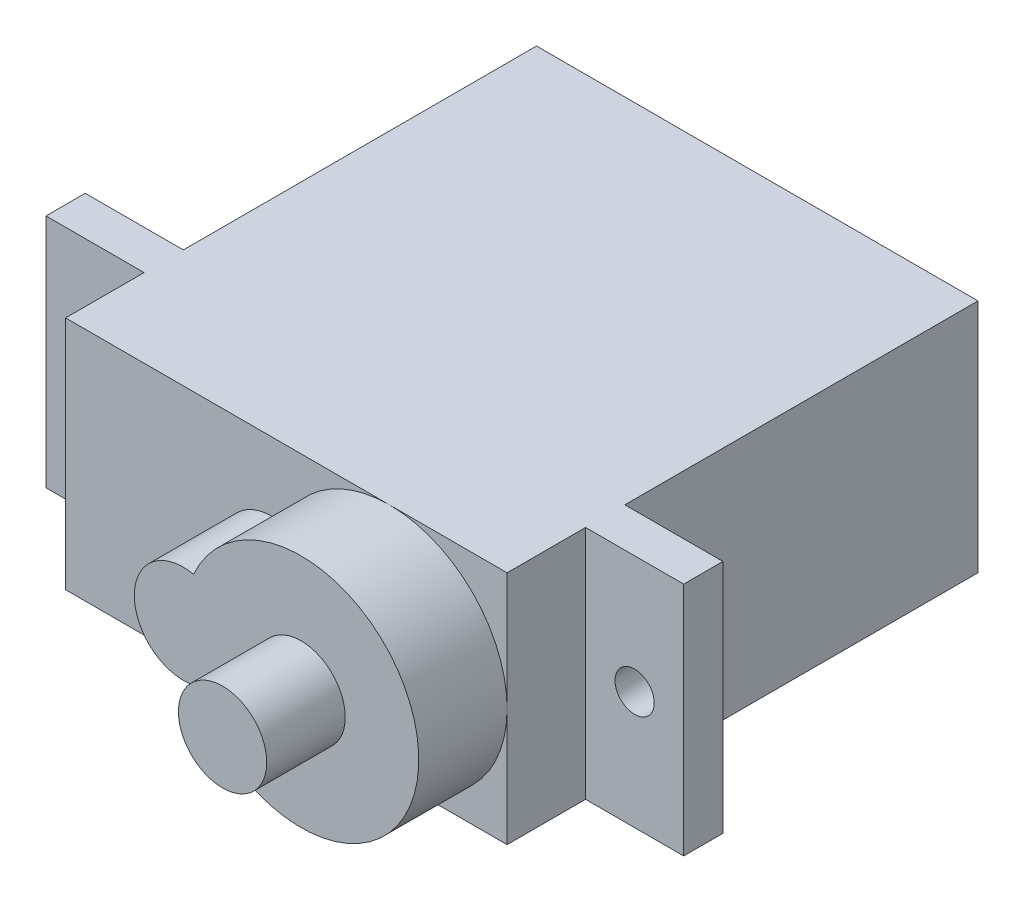
ISO-10303-21;
HEADER;
FILE_DESCRIPTION(('STEP AP214'),'2;1');
FILE_NAME('part.step','',(''),(''),'','','');
FILE_SCHEMA(('AUTOMOTIVE_DESIGN { 1 0 10303 214 1 1 1 1 }'));
ENDSEC;
DATA;
#1=APPLICATION_CONTEXT('core data for automotive mechanical design processes');
#2=APPLICATION_PROTOCOL_DEFINITION('international standard','automotive_design',2000,#1);
#3=PRODUCT_CONTEXT('',#1,'mechanical');
#4=PRODUCT('Part','Part','',(#3));
#5=PRODUCT_RELATED_PRODUCT_CATEGORY('part','',(#4));
#6=PRODUCT_DEFINITION_FORMATION('','',#4);
#7=PRODUCT_DEFINITION_CONTEXT('part definition',#1,'design');
#8=PRODUCT_DEFINITION('design','',#6,#7);
#9=PRODUCT_DEFINITION_SHAPE('','',#8);
#10=(LENGTH_UNIT() NAMED_UNIT(*) SI_UNIT(.MILLI.,.METRE.));
#11=(NAMED_UNIT(*) PLANE_ANGLE_UNIT() SI_UNIT($,.RADIAN.));
#12=(NAMED_UNIT(*) SI_UNIT($,.STERADIAN.) SOLID_ANGLE_UNIT());
#13=UNCERTAINTY_MEASURE_WITH_UNIT(LENGTH_MEASURE(1.E-05),#10,'distance_accuracy_value','');
#14=(GEOMETRIC_REPRESENTATION_CONTEXT(3) GLOBAL_UNCERTAINTY_ASSIGNED_CONTEXT((#13)) GLOBAL_UNIT_ASSIGNED_CONTEXT((#10,
#11,#12)) REPRESENTATION_CONTEXT('',''));
#15=CARTESIAN_POINT('',(0.,0.,0.));
#16=DIRECTION('',(0.,0.,1.));
#17=DIRECTION('',(1.,0.,0.));
#18=AXIS2_PLACEMENT_3D('',#15,#16,#17);
#19=CARTESIAN_POINT('',(0.,0.,24.));
#20=DIRECTION('',(0.,0.,1.));
#21=DIRECTION('',(1.,0.,0.));
#22=AXIS2_PLACEMENT_3D('',#19,#20,#21);
#23=PLANE('',#22);
#24=CARTESIAN_POINT('',(-0.750000000000016,0.,24.));
#25=DIRECTION('',(0.,0.,1.));
#26=DIRECTION('',(1.,0.,0.));
#27=AXIS2_PLACEMENT_3D('',#24,#25,#26);
#28=CIRCLE('',#27,2.5);
#29=CARTESIAN_POINT('',(-0.229166666666671,2.44514470714697,24.));
#30=VERTEX_POINT('',#29);
#31=CARTESIAN_POINT('',(-0.229166666666669,-2.44514470714698,24.));
#32=VERTEX_POINT('',#31);
#33=EDGE_CURVE('E162',#30,#32,#28,.T.);
#34=ORIENTED_EDGE('',*,*,#33,.F.);
#35=CARTESIAN_POINT('',(5.25,0.,24.));
#36=DIRECTION('',(0.,0.,1.));
#37=DIRECTION('',(1.,0.,0.));
#38=AXIS2_PLACEMENT_3D('',#35,#36,#37);
#39=CIRCLE('',#38,6.);
#40=CARTESIAN_POINT('',(5.25,6.,24.));
#41=VERTEX_POINT('',#40);
#42=EDGE_CURVE('E58',#41,#30,#39,.T.);
#43=ORIENTED_EDGE('',*,*,#42,.F.);
#44=DIRECTION('',(-1.,0.,0.));
#45=VECTOR('',#44,1.);
#46=CARTESIAN_POINT('',(-11.25,6.,24.));
#47=LINE('',#46,#45);
#48=CARTESIAN_POINT('',(-11.25,6.,24.));
#49=VERTEX_POINT('',#48);
#50=EDGE_CURVE('E186',#41,#49,#47,.T.);
#51=ORIENTED_EDGE('',*,*,#50,.T.);
#52=DIRECTION('',(0.,-1.,0.));
#53=VECTOR('',#52,1.);
#54=CARTESIAN_POINT('',(-11.25,6.,24.));
#55=LINE('',#54,#53);
#56=CARTESIAN_POINT('',(-11.25,-6.,24.));
#57=VERTEX_POINT('',#56);
#58=EDGE_CURVE('E175',#49,#57,#55,.T.);
#59=ORIENTED_EDGE('',*,*,#58,.T.);
#60=DIRECTION('',(1.,0.,0.));
#61=VECTOR('',#60,1.);
#62=CARTESIAN_POINT('',(-11.25,-6.,24.));
#63=LINE('',#62,#61);
#64=CARTESIAN_POINT('',(5.25,-6.,24.));
#65=VERTEX_POINT('',#64);
#66=EDGE_CURVE('E180',#57,#65,#63,.T.);
#67=ORIENTED_EDGE('',*,*,#66,.T.);
#68=EDGE_CURVE('E46',#32,#65,#39,.T.);
#69=ORIENTED_EDGE('',*,*,#68,.F.);
#70=EDGE_LOOP('',(#34,#43,#51,#59,#67,#69));
#71=FACE_BOUND('',#70,.T.);
#72=ADVANCED_FACE('F35',(#71),#23,.T.);
#73=CARTESIAN_POINT('',(11.25,0.,24.));
#74=VERTEX_POINT('',#73);
#75=EDGE_CURVE('E11',#65,#74,#39,.T.);
#76=ORIENTED_EDGE('',*,*,#75,.F.);
#77=CARTESIAN_POINT('',(11.25,-6.,24.));
#78=VERTEX_POINT('',#77);
#79=EDGE_CURVE('E178',#65,#78,#63,.T.);
#80=ORIENTED_EDGE('',*,*,#79,.T.);
#81=DIRECTION('',(0.,1.,0.));
#82=VECTOR('',#81,1.);
#83=CARTESIAN_POINT('',(11.25,6.,24.));
#84=LINE('',#83,#82);
#85=EDGE_CURVE('E183',#78,#74,#84,.T.);
#86=ORIENTED_EDGE('',*,*,#85,.T.);
#87=EDGE_LOOP('',(#76,#80,#86));
#88=FACE_BOUND('',#87,.T.);
#89=ADVANCED_FACE('F369',(#88),#23,.T.);
#90=CARTESIAN_POINT('',(0.,0.,20.));
#91=DIRECTION('',(0.,0.,1.));
#92=DIRECTION('',(1.,0.,0.));
#93=AXIS2_PLACEMENT_3D('',#90,#91,#92);
#94=PLANE('',#93);
#95=CARTESIAN_POINT('',(-13.75,0.,20.));
#96=DIRECTION('',(0.,0.,1.));
#97=DIRECTION('',(1.,0.,0.));
#98=AXIS2_PLACEMENT_3D('',#95,#96,#97);
#99=CIRCLE('',#98,1.);
#100=CARTESIAN_POINT('',(-12.75,0.,20.));
#101=VERTEX_POINT('',#100);
#102=EDGE_CURVE('E172',#101,#101,#99,.T.);
#103=ORIENTED_EDGE('',*,*,#102,.F.);
#104=EDGE_LOOP('',(#103));
#105=FACE_BOUND('',#104,.T.);
#106=DIRECTION('',(0.,-1.,0.));
#107=VECTOR('',#106,1.);
#108=CARTESIAN_POINT('',(-11.25,6.,20.));
#109=LINE('',#108,#107);
#110=CARTESIAN_POINT('',(-11.25,6.,20.));
#111=VERTEX_POINT('',#110);
#112=CARTESIAN_POINT('',(-11.25,-6.,20.));
#113=VERTEX_POINT('',#112);
#114=EDGE_CURVE('E196',#111,#113,#109,.T.);
#115=ORIENTED_EDGE('',*,*,#114,.F.);
#116=DIRECTION('',(-1.,0.,0.));
#117=VECTOR('',#116,1.);
#118=CARTESIAN_POINT('',(-16.25,6.,20.));
#119=LINE('',#118,#117);
#120=CARTESIAN_POINT('',(-16.25,6.,20.));
#121=VERTEX_POINT('',#120);
#122=EDGE_CURVE('E317',#111,#121,#119,.T.);
#123=ORIENTED_EDGE('',*,*,#122,.T.);
#124=DIRECTION('',(0.,-1.,0.));
#125=VECTOR('',#124,1.);
#126=CARTESIAN_POINT('',(-16.25,6.,20.));
#127=LINE('',#126,#125);
#128=CARTESIAN_POINT('',(-16.25,-6.,20.));
#129=VERTEX_POINT('',#128);
#130=EDGE_CURVE('E315',#121,#129,#127,.T.);
#131=ORIENTED_EDGE('',*,*,#130,.T.);
#132=DIRECTION('',(1.,0.,0.));
#133=VECTOR('',#132,1.);
#134=CARTESIAN_POINT('',(-16.25,-6.,20.));
#135=LINE('',#134,#133);
#136=EDGE_CURVE('E308',#129,#113,#135,.T.);
#137=ORIENTED_EDGE('',*,*,#136,.T.);
#138=EDGE_LOOP('',(#115,#123,#131,#137));
#139=FACE_BOUND('',#138,.T.);
#140=ADVANCED_FACE('F375',(#105,#139),#94,.T.);
#141=CARTESIAN_POINT('',(-11.25,6.,18.));
#142=DIRECTION('',(1.,0.,0.));
#143=DIRECTION('',(0.,0.,-1.));
#144=AXIS2_PLACEMENT_3D('',#141,#142,#143);
#145=PLANE('',#144);
#146=DIRECTION('',(0.,-1.,0.));
#147=VECTOR('',#146,1.);
#148=CARTESIAN_POINT('',(-11.25,6.,0.));
#149=LINE('',#148,#147);
#150=CARTESIAN_POINT('',(-11.25,6.,0.));
#151=VERTEX_POINT('',#150);
#152=CARTESIAN_POINT('',(-11.25,-6.,0.));
#153=VERTEX_POINT('',#152);
#154=EDGE_CURVE('E267',#151,#153,#149,.T.);
#155=ORIENTED_EDGE('',*,*,#154,.T.);
#156=DIRECTION('',(0.,0.,-1.));
#157=VECTOR('',#156,1.);
#158=CARTESIAN_POINT('',(-11.25,-6.,18.));
#159=LINE('',#158,#157);
#160=CARTESIAN_POINT('',(-11.25,-6.,18.));
#161=VERTEX_POINT('',#160);
#162=EDGE_CURVE('E295',#161,#153,#159,.T.);
#163=ORIENTED_EDGE('',*,*,#162,.F.);
#164=DIRECTION('',(0.,-1.,0.));
#165=VECTOR('',#164,1.);
#166=CARTESIAN_POINT('',(-11.25,6.,18.));
#167=LINE('',#166,#165);
#168=CARTESIAN_POINT('',(-11.25,6.,18.));
#169=VERTEX_POINT('',#168);
#170=EDGE_CURVE('E282',#169,#161,#167,.T.);
#171=ORIENTED_EDGE('',*,*,#170,.F.);
#172=DIRECTION('',(0.,0.,-1.));
#173=VECTOR('',#172,1.);
#174=CARTESIAN_POINT('',(-11.25,6.,18.));
#175=LINE('',#174,#173);
#176=EDGE_CURVE('E287',#169,#151,#175,.T.);
#177=ORIENTED_EDGE('',*,*,#176,.T.);
#178=EDGE_LOOP('',(#155,#163,#171,#177));
#179=FACE_BOUND('',#178,.T.);
#180=ADVANCED_FACE('F37',(#179),#145,.F.);
#181=CARTESIAN_POINT('',(-11.25,-6.,18.));
#182=DIRECTION('',(0.,1.,0.));
#183=DIRECTION('',(0.,0.,1.));
#184=AXIS2_PLACEMENT_3D('',#181,#182,#183);
#185=PLANE('',#184);
#186=DIRECTION('',(1.,0.,0.));
#187=VECTOR('',#186,1.);
#188=CARTESIAN_POINT('',(-11.25,-6.,0.));
#189=LINE('',#188,#187);
#190=CARTESIAN_POINT('',(11.25,-6.,0.));
#191=VERTEX_POINT('',#190);
#192=EDGE_CURVE('E269',#153,#191,#189,.T.);
#193=ORIENTED_EDGE('',*,*,#192,.T.);
#194=DIRECTION('',(0.,0.,-1.));
#195=VECTOR('',#194,1.);
#196=CARTESIAN_POINT('',(11.25,-6.,18.));
#197=LINE('',#196,#195);
#198=CARTESIAN_POINT('',(11.25,-6.,18.));
#199=VERTEX_POINT('',#198);
#200=EDGE_CURVE('E286',#199,#191,#197,.T.);
#201=ORIENTED_EDGE('',*,*,#200,.F.);
#202=DIRECTION('',(1.,0.,0.));
#203=VECTOR('',#202,1.);
#204=CARTESIAN_POINT('',(-16.25,-6.,18.));
#205=LINE('',#204,#203);
#206=CARTESIAN_POINT('',(16.25,-6.,18.));
#207=VERTEX_POINT('',#206);
#208=EDGE_CURVE('E229',#199,#207,#205,.T.);
#209=ORIENTED_EDGE('',*,*,#208,.T.);
#210=DIRECTION('',(0.,0.,-1.));
#211=VECTOR('',#210,1.);
#212=CARTESIAN_POINT('',(16.25,-6.,20.));
#213=LINE('',#212,#211);
#214=CARTESIAN_POINT('',(16.25,-6.,20.));
#215=VERTEX_POINT('',#214);
#216=EDGE_CURVE('E263',#215,#207,#213,.T.);
#217=ORIENTED_EDGE('',*,*,#216,.F.);
#218=CARTESIAN_POINT('',(11.25,-6.,20.));
#219=VERTEX_POINT('',#218);
#220=EDGE_CURVE('E312',#219,#215,#135,.T.);
#221=ORIENTED_EDGE('',*,*,#220,.F.);
#222=DIRECTION('',(0.,0.,-1.));
#223=VECTOR('',#222,1.);
#224=CARTESIAN_POINT('',(11.25,-6.,24.));
#225=LINE('',#224,#223);
#226=EDGE_CURVE('E209',#78,#219,#225,.T.);
#227=ORIENTED_EDGE('',*,*,#226,.F.);
#228=ORIENTED_EDGE('',*,*,#79,.F.);
#229=ORIENTED_EDGE('',*,*,#66,.F.);
#230=DIRECTION('',(0.,0.,-1.));
#231=VECTOR('',#230,1.);
#232=CARTESIAN_POINT('',(-11.25,-6.,24.));
#233=LINE('',#232,#231);
#234=EDGE_CURVE('E216',#57,#113,#233,.T.);
#235=ORIENTED_EDGE('',*,*,#234,.T.);
#236=ORIENTED_EDGE('',*,*,#136,.F.);
#237=DIRECTION('',(0.,0.,-1.));
#238=VECTOR('',#237,1.);
#239=CARTESIAN_POINT('',(-16.25,-6.,20.));
#240=LINE('',#239,#238);
#241=CARTESIAN_POINT('',(-16.25,-6.,18.));
#242=VERTEX_POINT('',#241);
#243=EDGE_CURVE('E265',#129,#242,#240,.T.);
#244=ORIENTED_EDGE('',*,*,#243,.T.);
#245=EDGE_CURVE('E235',#242,#161,#205,.T.);
#246=ORIENTED_EDGE('',*,*,#245,.T.);
#247=ORIENTED_EDGE('',*,*,#162,.T.);
#248=EDGE_LOOP('',(#193,#201,#209,#217,#221,#227,#228,#229,#235,#236,#244,#246,#247));
#249=FACE_BOUND('',#248,.T.);
#250=ADVANCED_FACE('F334',(#249),#185,.F.);
#251=CARTESIAN_POINT('',(11.25,6.,18.));
#252=DIRECTION('',(-1.,0.,0.));
#253=DIRECTION('',(0.,-1.,0.));
#254=AXIS2_PLACEMENT_3D('',#251,#252,#253);
#255=PLANE('',#254);
#256=DIRECTION('',(0.,1.,0.));
#257=VECTOR('',#256,1.);
#258=CARTESIAN_POINT('',(11.25,6.,0.));
#259=LINE('',#258,#257);
#260=CARTESIAN_POINT('',(11.25,6.,0.));
#261=VERTEX_POINT('',#260);
#262=EDGE_CURVE('E274',#191,#261,#259,.T.);
#263=ORIENTED_EDGE('',*,*,#262,.T.);
#264=DIRECTION('',(0.,0.,-1.));
#265=VECTOR('',#264,1.);
#266=CARTESIAN_POINT('',(11.25,6.,18.));
#267=LINE('',#266,#265);
#268=CARTESIAN_POINT('',(11.25,6.,18.));
#269=VERTEX_POINT('',#268);
#270=EDGE_CURVE('E283',#269,#261,#267,.T.);
#271=ORIENTED_EDGE('',*,*,#270,.F.);
#272=DIRECTION('',(0.,1.,0.));
#273=VECTOR('',#272,1.);
#274=CARTESIAN_POINT('',(11.25,6.,18.));
#275=LINE('',#274,#273);
#276=EDGE_CURVE('E290',#199,#269,#275,.T.);
#277=ORIENTED_EDGE('',*,*,#276,.F.);
#278=ORIENTED_EDGE('',*,*,#200,.T.);
#279=EDGE_LOOP('',(#263,#271,#277,#278));
#280=FACE_BOUND('',#279,.T.);
#281=ADVANCED_FACE('F347',(#280),#255,.F.);
#282=CARTESIAN_POINT('',(-11.25,6.,18.));
#283=DIRECTION('',(0.,-1.,0.));
#284=DIRECTION('',(0.,0.,-1.));
#285=AXIS2_PLACEMENT_3D('',#282,#283,#284);
#286=PLANE('',#285);
#287=DIRECTION('',(-1.,0.,0.));
#288=VECTOR('',#287,1.);
#289=CARTESIAN_POINT('',(-11.25,6.,0.));
#290=LINE('',#289,#288);
#291=EDGE_CURVE('E280',#261,#151,#290,.T.);
#292=ORIENTED_EDGE('',*,*,#291,.T.);
#293=ORIENTED_EDGE('',*,*,#176,.F.);
#294=DIRECTION('',(-1.,0.,0.));
#295=VECTOR('',#294,1.);
#296=CARTESIAN_POINT('',(-16.25,6.,18.));
#297=LINE('',#296,#295);
#298=CARTESIAN_POINT('',(-16.25,6.,18.));
#299=VERTEX_POINT('',#298);
#300=EDGE_CURVE('E250',#169,#299,#297,.T.);
#301=ORIENTED_EDGE('',*,*,#300,.T.);
#302=DIRECTION('',(0.,0.,-1.));
#303=VECTOR('',#302,1.);
#304=CARTESIAN_POINT('',(-16.25,6.,20.));
#305=LINE('',#304,#303);
#306=EDGE_CURVE('E256',#121,#299,#305,.T.);
#307=ORIENTED_EDGE('',*,*,#306,.F.);
#308=ORIENTED_EDGE('',*,*,#122,.F.);
#309=DIRECTION('',(0.,0.,-1.));
#310=VECTOR('',#309,1.);
#311=CARTESIAN_POINT('',(-11.25,6.,24.));
#312=LINE('',#311,#310);
#313=EDGE_CURVE('E190',#49,#111,#312,.T.);
#314=ORIENTED_EDGE('',*,*,#313,.F.);
#315=ORIENTED_EDGE('',*,*,#50,.F.);
#316=CARTESIAN_POINT('',(11.25,6.,24.));
#317=VERTEX_POINT('',#316);
#318=EDGE_CURVE('E187',#317,#41,#47,.T.);
#319=ORIENTED_EDGE('',*,*,#318,.F.);
#320=DIRECTION('',(0.,0.,-1.));
#321=VECTOR('',#320,1.);
#322=CARTESIAN_POINT('',(11.25,6.,24.));
#323=LINE('',#322,#321);
#324=CARTESIAN_POINT('',(11.25,6.,20.));
#325=VERTEX_POINT('',#324);
#326=EDGE_CURVE('E203',#317,#325,#323,.T.);
#327=ORIENTED_EDGE('',*,*,#326,.T.);
#328=CARTESIAN_POINT('',(16.25,6.,20.));
#329=VERTEX_POINT('',#328);
#330=EDGE_CURVE('E260',#329,#325,#119,.T.);
#331=ORIENTED_EDGE('',*,*,#330,.F.);
#332=DIRECTION('',(0.,0.,-1.));
#333=VECTOR('',#332,1.);
#334=CARTESIAN_POINT('',(16.25,6.,20.));
#335=LINE('',#334,#333);
#336=CARTESIAN_POINT('',(16.25,6.,18.));
#337=VERTEX_POINT('',#336);
#338=EDGE_CURVE('E259',#329,#337,#335,.T.);
#339=ORIENTED_EDGE('',*,*,#338,.T.);
#340=EDGE_CURVE('E252',#337,#269,#297,.T.);
#341=ORIENTED_EDGE('',*,*,#340,.T.);
#342=ORIENTED_EDGE('',*,*,#270,.T.);
#343=EDGE_LOOP('',(#292,#293,#301,#307,#308,#314,#315,#319,#327,#331,#339,#341,#342));
#344=FACE_BOUND('',#343,.T.);
#345=ADVANCED_FACE('F339',(#344),#286,.F.);
#346=CARTESIAN_POINT('',(0.,0.,0.));
#347=DIRECTION('',(0.,0.,1.));
#348=DIRECTION('',(1.,0.,0.));
#349=AXIS2_PLACEMENT_3D('',#346,#347,#348);
#350=PLANE('',#349);
#351=ORIENTED_EDGE('',*,*,#154,.F.);
#352=ORIENTED_EDGE('',*,*,#291,.F.);
#353=ORIENTED_EDGE('',*,*,#262,.F.);
#354=ORIENTED_EDGE('',*,*,#192,.F.);
#355=EDGE_LOOP('',(#351,#352,#353,#354));
#356=FACE_BOUND('',#355,.T.);
#357=ADVANCED_FACE('F350',(#356),#350,.F.);
#358=CARTESIAN_POINT('',(0.,0.,18.));
#359=DIRECTION('',(0.,0.,1.));
#360=DIRECTION('',(1.,0.,0.));
#361=AXIS2_PLACEMENT_3D('',#358,#359,#360);
#362=PLANE('',#361);
#363=CARTESIAN_POINT('',(-13.75,0.,18.));
#364=DIRECTION('',(0.,0.,1.));
#365=DIRECTION('',(1.,0.,0.));
#366=AXIS2_PLACEMENT_3D('',#363,#364,#365);
#367=CIRCLE('',#366,1.);
#368=CARTESIAN_POINT('',(-12.75,0.,18.));
#369=VERTEX_POINT('',#368);
#370=EDGE_CURVE('E39',#369,#369,#367,.T.);
#371=ORIENTED_EDGE('',*,*,#370,.T.);
#372=EDGE_LOOP('',(#371));
#373=FACE_BOUND('',#372,.T.);
#374=ORIENTED_EDGE('',*,*,#300,.F.);
#375=ORIENTED_EDGE('',*,*,#170,.T.);
#376=ORIENTED_EDGE('',*,*,#245,.F.);
#377=DIRECTION('',(0.,-1.,0.));
#378=VECTOR('',#377,1.);
#379=CARTESIAN_POINT('',(-16.25,6.,18.));
#380=LINE('',#379,#378);
#381=EDGE_CURVE('E225',#299,#242,#380,.T.);
#382=ORIENTED_EDGE('',*,*,#381,.F.);
#383=EDGE_LOOP('',(#374,#375,#376,#382));
#384=FACE_BOUND('',#383,.T.);
#385=ADVANCED_FACE('F354',(#373,#384),#362,.F.);
#386=CARTESIAN_POINT('',(13.75,0.,18.));
#387=DIRECTION('',(0.,0.,1.));
#388=DIRECTION('',(1.,0.,0.));
#389=AXIS2_PLACEMENT_3D('',#386,#387,#388);
#390=CIRCLE('',#389,1.);
#391=CARTESIAN_POINT('',(14.75,0.,18.));
#392=VERTEX_POINT('',#391);
#393=EDGE_CURVE('E166',#392,#392,#390,.T.);
#394=ORIENTED_EDGE('',*,*,#393,.T.);
#395=EDGE_LOOP('',(#394));
#396=FACE_BOUND('',#395,.T.);
#397=ORIENTED_EDGE('',*,*,#208,.F.);
#398=ORIENTED_EDGE('',*,*,#276,.T.);
#399=ORIENTED_EDGE('',*,*,#340,.F.);
#400=DIRECTION('',(0.,1.,0.));
#401=VECTOR('',#400,1.);
#402=CARTESIAN_POINT('',(16.25,6.,18.));
#403=LINE('',#402,#401);
#404=EDGE_CURVE('E243',#207,#337,#403,.T.);
#405=ORIENTED_EDGE('',*,*,#404,.F.);
#406=EDGE_LOOP('',(#397,#398,#399,#405));
#407=FACE_BOUND('',#406,.T.);
#408=ADVANCED_FACE('F344',(#396,#407),#362,.F.);
#409=CARTESIAN_POINT('',(-16.25,6.,20.));
#410=DIRECTION('',(1.,0.,0.));
#411=DIRECTION('',(0.,0.,-1.));
#412=AXIS2_PLACEMENT_3D('',#409,#410,#411);
#413=PLANE('',#412);
#414=ORIENTED_EDGE('',*,*,#381,.T.);
#415=ORIENTED_EDGE('',*,*,#243,.F.);
#416=ORIENTED_EDGE('',*,*,#130,.F.);
#417=ORIENTED_EDGE('',*,*,#306,.T.);
#418=EDGE_LOOP('',(#414,#415,#416,#417));
#419=FACE_BOUND('',#418,.T.);
#420=ADVANCED_FACE('F355',(#419),#413,.F.);
#421=CARTESIAN_POINT('',(16.25,6.,20.));
#422=DIRECTION('',(-1.,0.,0.));
#423=DIRECTION('',(0.,0.,1.));
#424=AXIS2_PLACEMENT_3D('',#421,#422,#423);
#425=PLANE('',#424);
#426=ORIENTED_EDGE('',*,*,#404,.T.);
#427=ORIENTED_EDGE('',*,*,#338,.F.);
#428=DIRECTION('',(0.,1.,0.));
#429=VECTOR('',#428,1.);
#430=CARTESIAN_POINT('',(16.25,6.,20.));
#431=LINE('',#430,#429);
#432=EDGE_CURVE('E311',#215,#329,#431,.T.);
#433=ORIENTED_EDGE('',*,*,#432,.F.);
#434=ORIENTED_EDGE('',*,*,#216,.T.);
#435=EDGE_LOOP('',(#426,#427,#433,#434));
#436=FACE_BOUND('',#435,.T.);
#437=ADVANCED_FACE('F357',(#436),#425,.F.);
#438=CARTESIAN_POINT('',(13.75,0.,20.));
#439=DIRECTION('',(0.,0.,1.));
#440=DIRECTION('',(1.,0.,0.));
#441=AXIS2_PLACEMENT_3D('',#438,#439,#440);
#442=CIRCLE('',#441,1.);
#443=CARTESIAN_POINT('',(14.75,0.,20.));
#444=VERTEX_POINT('',#443);
#445=EDGE_CURVE('E163',#444,#444,#442,.T.);
#446=ORIENTED_EDGE('',*,*,#445,.F.);
#447=EDGE_LOOP('',(#446));
#448=FACE_BOUND('',#447,.T.);
#449=DIRECTION('',(0.,1.,0.));
#450=VECTOR('',#449,1.);
#451=CARTESIAN_POINT('',(11.25,6.,20.));
#452=LINE('',#451,#450);
#453=EDGE_CURVE('E179',#219,#325,#452,.T.);
#454=ORIENTED_EDGE('',*,*,#453,.F.);
#455=ORIENTED_EDGE('',*,*,#220,.T.);
#456=ORIENTED_EDGE('',*,*,#432,.T.);
#457=ORIENTED_EDGE('',*,*,#330,.T.);
#458=EDGE_LOOP('',(#454,#455,#456,#457));
#459=FACE_BOUND('',#458,.T.);
#460=ADVANCED_FACE('F326',(#448,#459),#94,.T.);
#461=CARTESIAN_POINT('',(-11.25,6.,24.));
#462=DIRECTION('',(1.,0.,0.));
#463=DIRECTION('',(0.,1.,0.));
#464=AXIS2_PLACEMENT_3D('',#461,#462,#463);
#465=PLANE('',#464);
#466=ORIENTED_EDGE('',*,*,#114,.T.);
#467=ORIENTED_EDGE('',*,*,#234,.F.);
#468=ORIENTED_EDGE('',*,*,#58,.F.);
#469=ORIENTED_EDGE('',*,*,#313,.T.);
#470=EDGE_LOOP('',(#466,#467,#468,#469));
#471=FACE_BOUND('',#470,.T.);
#472=ADVANCED_FACE('F388',(#471),#465,.F.);
#473=CARTESIAN_POINT('',(11.25,6.,24.));
#474=DIRECTION('',(-1.,0.,0.));
#475=DIRECTION('',(0.,-1.,0.));
#476=AXIS2_PLACEMENT_3D('',#473,#474,#475);
#477=PLANE('',#476);
#478=ORIENTED_EDGE('',*,*,#453,.T.);
#479=ORIENTED_EDGE('',*,*,#326,.F.);
#480=EDGE_CURVE('E182',#74,#317,#84,.T.);
#481=ORIENTED_EDGE('',*,*,#480,.F.);
#482=ORIENTED_EDGE('',*,*,#85,.F.);
#483=ORIENTED_EDGE('',*,*,#226,.T.);
#484=EDGE_LOOP('',(#478,#479,#481,#482,#483));
#485=FACE_BOUND('',#484,.T.);
#486=ADVANCED_FACE('F329',(#485),#477,.F.);
#487=EDGE_CURVE('E44',#74,#41,#39,.T.);
#488=ORIENTED_EDGE('',*,*,#487,.F.);
#489=ORIENTED_EDGE('',*,*,#480,.T.);
#490=ORIENTED_EDGE('',*,*,#318,.T.);
#491=EDGE_LOOP('',(#488,#489,#490));
#492=FACE_BOUND('',#491,.T.);
#493=ADVANCED_FACE('F371',(#492),#23,.T.);
#494=CARTESIAN_POINT('',(-13.75,0.,-2.50000000007189E-05));
#495=DIRECTION('',(0.,0.,1.));
#496=DIRECTION('',(1.,0.,0.));
#497=AXIS2_PLACEMENT_3D('',#494,#495,#496);
#498=CYLINDRICAL_SURFACE('',#497,1.);
#499=ORIENTED_EDGE('',*,*,#102,.T.);
#500=EDGE_LOOP('',(#499));
#501=FACE_BOUND('',#500,.T.);
#502=ORIENTED_EDGE('',*,*,#370,.F.);
#503=EDGE_LOOP('',(#502));
#504=FACE_BOUND('',#503,.T.);
#505=ADVANCED_FACE('F380',(#501,#504),#498,.F.);
#506=CARTESIAN_POINT('',(13.75,0.,-2.50000000007189E-05));
#507=DIRECTION('',(0.,0.,1.));
#508=DIRECTION('',(1.,0.,0.));
#509=AXIS2_PLACEMENT_3D('',#506,#507,#508);
#510=CYLINDRICAL_SURFACE('',#509,1.);
#511=ORIENTED_EDGE('',*,*,#445,.T.);
#512=EDGE_LOOP('',(#511));
#513=FACE_BOUND('',#512,.T.);
#514=ORIENTED_EDGE('',*,*,#393,.F.);
#515=EDGE_LOOP('',(#514));
#516=FACE_BOUND('',#515,.T.);
#517=ADVANCED_FACE('F386',(#513,#516),#510,.F.);
#518=CARTESIAN_POINT('',(-0.750000000000016,0.,28.5));
#519=DIRECTION('',(0.,0.,-1.));
#520=DIRECTION('',(-1.,0.,0.));
#521=AXIS2_PLACEMENT_3D('',#518,#519,#520);
#522=CYLINDRICAL_SURFACE('',#521,2.5);
#523=ORIENTED_EDGE('',*,*,#33,.T.);
#524=DIRECTION('',(0.,0.,-1.));
#525=VECTOR('',#524,1.);
#526=CARTESIAN_POINT('',(-0.229166666666669,-2.44514470714698,28.5));
#527=LINE('',#526,#525);
#528=CARTESIAN_POINT('',(-0.229166666666669,-2.44514470714698,28.5));
#529=VERTEX_POINT('',#528);
#530=EDGE_CURVE('E150',#529,#32,#527,.T.);
#531=ORIENTED_EDGE('',*,*,#530,.F.);
#532=CARTESIAN_POINT('',(-0.750000000000016,0.,28.5));
#533=DIRECTION('',(0.,0.,1.));
#534=DIRECTION('',(1.,0.,0.));
#535=AXIS2_PLACEMENT_3D('',#532,#533,#534);
#536=CIRCLE('',#535,2.5);
#537=CARTESIAN_POINT('',(-0.229166666666671,2.44514470714697,28.5));
#538=VERTEX_POINT('',#537);
#539=EDGE_CURVE('E156',#538,#529,#536,.T.);
#540=ORIENTED_EDGE('',*,*,#539,.F.);
#541=DIRECTION('',(0.,0.,-1.));
#542=VECTOR('',#541,1.);
#543=CARTESIAN_POINT('',(-0.229166666666671,2.44514470714697,28.5));
#544=LINE('',#543,#542);
#545=EDGE_CURVE('E153',#538,#30,#544,.T.);
#546=ORIENTED_EDGE('',*,*,#545,.T.);
#547=EDGE_LOOP('',(#523,#531,#540,#546));
#548=FACE_BOUND('',#547,.T.);
#549=ADVANCED_FACE('F161',(#548),#522,.T.);
#550=CARTESIAN_POINT('',(5.25,0.,28.5));
#551=DIRECTION('',(0.,0.,-1.));
#552=DIRECTION('',(-1.,0.,0.));
#553=AXIS2_PLACEMENT_3D('',#550,#551,#552);
#554=CYLINDRICAL_SURFACE('',#553,6.);
#555=ORIENTED_EDGE('',*,*,#68,.T.);
#556=ORIENTED_EDGE('',*,*,#75,.T.);
#557=ORIENTED_EDGE('',*,*,#487,.T.);
#558=ORIENTED_EDGE('',*,*,#42,.T.);
#559=ORIENTED_EDGE('',*,*,#545,.F.);
#560=CARTESIAN_POINT('',(5.25,0.,28.5));
#561=DIRECTION('',(0.,0.,1.));
#562=DIRECTION('',(1.,0.,0.));
#563=AXIS2_PLACEMENT_3D('',#560,#561,#562);
#564=CIRCLE('',#563,6.);
#565=EDGE_CURVE('E146',#529,#538,#564,.T.);
#566=ORIENTED_EDGE('',*,*,#565,.F.);
#567=ORIENTED_EDGE('',*,*,#530,.T.);
#568=EDGE_LOOP('',(#555,#556,#557,#558,#559,#566,#567));
#569=FACE_BOUND('',#568,.T.);
#570=ADVANCED_FACE('F148',(#569),#554,.T.);
#571=CARTESIAN_POINT('',(2.24999999999999,0.,28.5));
#572=DIRECTION('',(0.,0.,1.));
#573=DIRECTION('',(1.,0.,0.));
#574=AXIS2_PLACEMENT_3D('',#571,#572,#573);
#575=PLANE('',#574);
#576=CARTESIAN_POINT('',(5.25,0.,28.5));
#577=DIRECTION('',(0.,0.,1.));
#578=DIRECTION('',(1.,0.,0.));
#579=AXIS2_PLACEMENT_3D('',#576,#577,#578);
#580=CIRCLE('',#579,2.25);
#581=CARTESIAN_POINT('',(7.5,0.,28.5));
#582=VERTEX_POINT('',#581);
#583=EDGE_CURVE('E393',#582,#582,#580,.T.);
#584=ORIENTED_EDGE('',*,*,#583,.F.);
#585=EDGE_LOOP('',(#584));
#586=FACE_BOUND('',#585,.T.);
#587=ORIENTED_EDGE('',*,*,#539,.T.);
#588=ORIENTED_EDGE('',*,*,#565,.T.);
#589=EDGE_LOOP('',(#587,#588));
#590=FACE_BOUND('',#589,.T.);
#591=ADVANCED_FACE('F158',(#586,#590),#575,.T.);
#592=CARTESIAN_POINT('',(5.25,0.,32.5));
#593=DIRECTION('',(0.,0.,-1.));
#594=DIRECTION('',(-1.,0.,0.));
#595=AXIS2_PLACEMENT_3D('',#592,#593,#594);
#596=CYLINDRICAL_SURFACE('',#595,2.25);
#597=CARTESIAN_POINT('',(5.25,0.,32.5));
#598=DIRECTION('',(0.,0.,1.));
#599=DIRECTION('',(1.,0.,0.));
#600=AXIS2_PLACEMENT_3D('',#597,#598,#599);
#601=CIRCLE('',#600,2.25);
#602=CARTESIAN_POINT('',(7.5,0.,32.5));
#603=VERTEX_POINT('',#602);
#604=EDGE_CURVE('E390',#603,#603,#601,.T.);
#605=ORIENTED_EDGE('',*,*,#604,.F.);
#606=EDGE_LOOP('',(#605));
#607=FACE_BOUND('',#606,.T.);
#608=ORIENTED_EDGE('',*,*,#583,.T.);
#609=EDGE_LOOP('',(#608));
#610=FACE_BOUND('',#609,.T.);
#611=ADVANCED_FACE('F401',(#607,#610),#596,.T.);
#612=CARTESIAN_POINT('',(5.25,0.,32.5));
#613=DIRECTION('',(0.,0.,1.));
#614=DIRECTION('',(1.,0.,0.));
#615=AXIS2_PLACEMENT_3D('',#612,#613,#614);
#616=PLANE('',#615);
#617=ORIENTED_EDGE('',*,*,#604,.T.);
#618=EDGE_LOOP('',(#617));
#619=FACE_BOUND('',#618,.T.);
#620=ADVANCED_FACE('F399',(#619),#616,.T.);
#621=CLOSED_SHELL('',(#72,#89,#140,#180,#250,#281,#345,#357,#385,#408,#420,#437,#460,#472,#486,
#493,#505,#517,#549,#570,#591,#611,#620));
#622=MANIFOLD_SOLID_BREP('B2',#621);
#623=ADVANCED_BREP_SHAPE_REPRESENTATION('',(#18,#622),#14);
#624=SHAPE_DEFINITION_REPRESENTATION(#9,#623);
ENDSEC;
END-ISO-10303-21;
